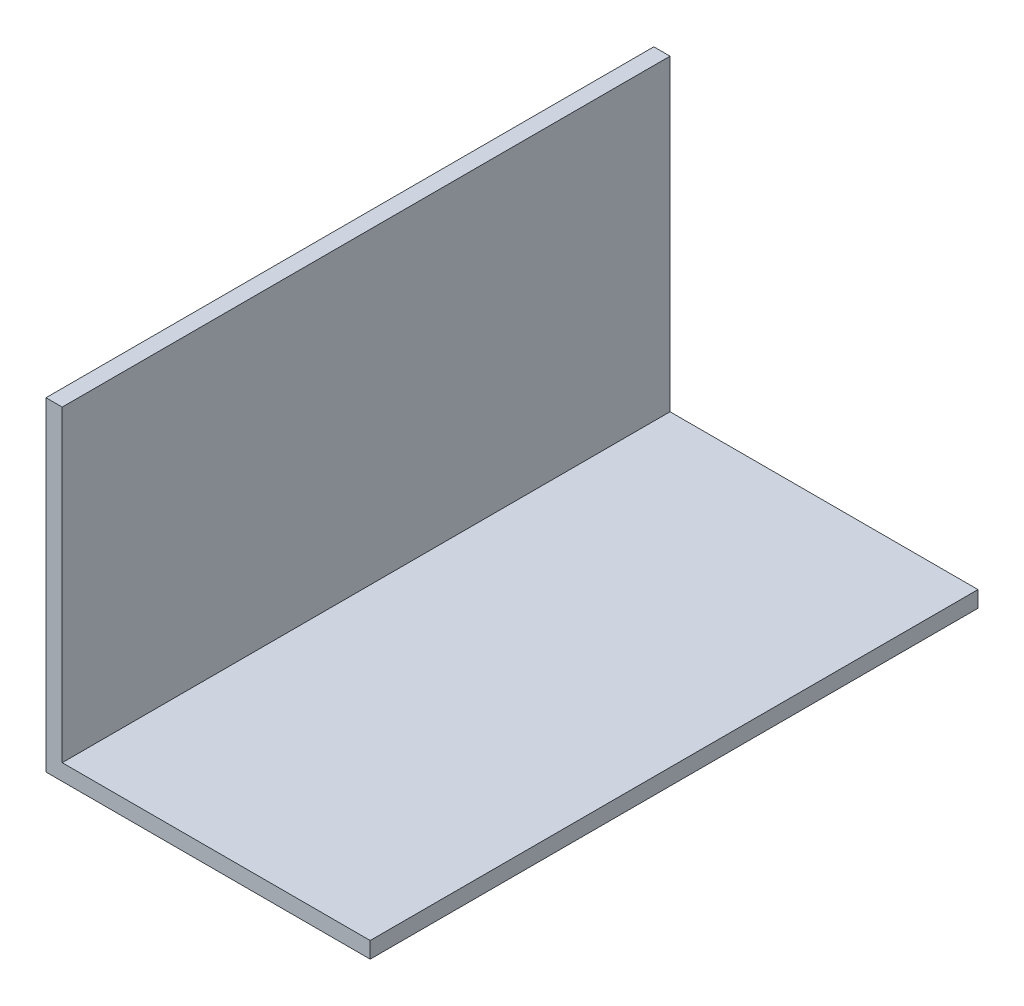
ISO-10303-21;
HEADER;
FILE_DESCRIPTION(('STEP AP214'),'2;1');
FILE_NAME('part.step','',(''),(''),'','','');
FILE_SCHEMA(('AUTOMOTIVE_DESIGN { 1 0 10303 214 1 1 1 1 }'));
ENDSEC;
DATA;
#1=APPLICATION_CONTEXT('core data for automotive mechanical design processes');
#2=APPLICATION_PROTOCOL_DEFINITION('international standard','automotive_design',2000,#1);
#3=PRODUCT_CONTEXT('',#1,'mechanical');
#4=PRODUCT('Part','Part','',(#3));
#5=PRODUCT_RELATED_PRODUCT_CATEGORY('part','',(#4));
#6=PRODUCT_DEFINITION_FORMATION('','',#4);
#7=PRODUCT_DEFINITION_CONTEXT('part definition',#1,'design');
#8=PRODUCT_DEFINITION('design','',#6,#7);
#9=PRODUCT_DEFINITION_SHAPE('','',#8);
#10=(LENGTH_UNIT() NAMED_UNIT(*) SI_UNIT(.MILLI.,.METRE.));
#11=(NAMED_UNIT(*) PLANE_ANGLE_UNIT() SI_UNIT($,.RADIAN.));
#12=(NAMED_UNIT(*) SI_UNIT($,.STERADIAN.) SOLID_ANGLE_UNIT());
#13=UNCERTAINTY_MEASURE_WITH_UNIT(LENGTH_MEASURE(1.E-05),#10,'distance_accuracy_value','');
#14=(GEOMETRIC_REPRESENTATION_CONTEXT(3) GLOBAL_UNCERTAINTY_ASSIGNED_CONTEXT((#13)) GLOBAL_UNIT_ASSIGNED_CONTEXT((#10,
#11,#12)) REPRESENTATION_CONTEXT('',''));
#15=CARTESIAN_POINT('',(0.,0.,0.));
#16=DIRECTION('',(0.,0.,1.));
#17=DIRECTION('',(1.,0.,0.));
#18=AXIS2_PLACEMENT_3D('',#15,#16,#17);
#19=CARTESIAN_POINT('',(-2.,0.,150.));
#20=DIRECTION('',(1.,0.,0.));
#21=DIRECTION('',(0.,1.,0.));
#22=AXIS2_PLACEMENT_3D('',#19,#20,#21);
#23=PLANE('',#22);
#24=DIRECTION('',(0.,-1.,0.));
#25=VECTOR('',#24,1.);
#26=CARTESIAN_POINT('',(-2.,0.,0.));
#27=LINE('',#26,#25);
#28=CARTESIAN_POINT('',(-2.,40.,0.));
#29=VERTEX_POINT('',#28);
#30=CARTESIAN_POINT('',(-2.,-40.,0.));
#31=VERTEX_POINT('',#30);
#32=EDGE_CURVE('E136',#29,#31,#27,.T.);
#33=ORIENTED_EDGE('',*,*,#32,.T.);
#34=DIRECTION('',(0.,0.,-1.));
#35=VECTOR('',#34,1.);
#36=CARTESIAN_POINT('',(-2.,-40.,150.));
#37=LINE('',#36,#35);
#38=CARTESIAN_POINT('',(-2.,-40.,150.));
#39=VERTEX_POINT('',#38);
#40=EDGE_CURVE('E11',#39,#31,#37,.T.);
#41=ORIENTED_EDGE('',*,*,#40,.F.);
#42=DIRECTION('',(0.,-1.,0.));
#43=VECTOR('',#42,1.);
#44=CARTESIAN_POINT('',(-2.,0.,150.));
#45=LINE('',#44,#43);
#46=CARTESIAN_POINT('',(-2.,40.,150.));
#47=VERTEX_POINT('',#46);
#48=EDGE_CURVE('E155',#47,#39,#45,.T.);
#49=ORIENTED_EDGE('',*,*,#48,.F.);
#50=DIRECTION('',(0.,0.,-1.));
#51=VECTOR('',#50,1.);
#52=CARTESIAN_POINT('',(-2.,40.,150.));
#53=LINE('',#52,#51);
#54=EDGE_CURVE('E64',#47,#29,#53,.T.);
#55=ORIENTED_EDGE('',*,*,#54,.T.);
#56=EDGE_LOOP('',(#33,#41,#49,#55));
#57=FACE_BOUND('',#56,.T.);
#58=ADVANCED_FACE('F47',(#57),#23,.F.);
#59=CARTESIAN_POINT('',(0.,-40.,150.));
#60=DIRECTION('',(0.,1.,0.));
#61=DIRECTION('',(0.,0.,1.));
#62=AXIS2_PLACEMENT_3D('',#59,#60,#61);
#63=PLANE('',#62);
#64=DIRECTION('',(1.,0.,0.));
#65=VECTOR('',#64,1.);
#66=CARTESIAN_POINT('',(0.,-40.,0.));
#67=LINE('',#66,#65);
#68=CARTESIAN_POINT('',(78.,-40.0000000000001,0.));
#69=VERTEX_POINT('',#68);
#70=EDGE_CURVE('E139',#31,#69,#67,.T.);
#71=ORIENTED_EDGE('',*,*,#70,.T.);
#72=DIRECTION('',(0.,0.,-1.));
#73=VECTOR('',#72,1.);
#74=CARTESIAN_POINT('',(78.,-40.0000000000001,150.));
#75=LINE('',#74,#73);
#76=CARTESIAN_POINT('',(78.,-40.0000000000001,150.));
#77=VERTEX_POINT('',#76);
#78=EDGE_CURVE('E56',#77,#69,#75,.T.);
#79=ORIENTED_EDGE('',*,*,#78,.F.);
#80=DIRECTION('',(1.,0.,0.));
#81=VECTOR('',#80,1.);
#82=CARTESIAN_POINT('',(0.,-40.,150.));
#83=LINE('',#82,#81);
#84=EDGE_CURVE('E96',#39,#77,#83,.T.);
#85=ORIENTED_EDGE('',*,*,#84,.F.);
#86=ORIENTED_EDGE('',*,*,#40,.T.);
#87=EDGE_LOOP('',(#71,#79,#85,#86));
#88=FACE_BOUND('',#87,.T.);
#89=ADVANCED_FACE('F179',(#88),#63,.F.);
#90=CARTESIAN_POINT('',(78.,0.,150.));
#91=DIRECTION('',(-1.,0.,0.));
#92=DIRECTION('',(0.,0.,1.));
#93=AXIS2_PLACEMENT_3D('',#90,#91,#92);
#94=PLANE('',#93);
#95=DIRECTION('',(0.,1.,0.));
#96=VECTOR('',#95,1.);
#97=CARTESIAN_POINT('',(78.,0.,0.));
#98=LINE('',#97,#96);
#99=CARTESIAN_POINT('',(78.,-36.0000000000001,0.));
#100=VERTEX_POINT('',#99);
#101=EDGE_CURVE('E142',#69,#100,#98,.T.);
#102=ORIENTED_EDGE('',*,*,#101,.T.);
#103=DIRECTION('',(0.,0.,-1.));
#104=VECTOR('',#103,1.);
#105=CARTESIAN_POINT('',(78.,-36.0000000000001,150.));
#106=LINE('',#105,#104);
#107=CARTESIAN_POINT('',(78.,-36.0000000000001,150.));
#108=VERTEX_POINT('',#107);
#109=EDGE_CURVE('E116',#108,#100,#106,.T.);
#110=ORIENTED_EDGE('',*,*,#109,.F.);
#111=DIRECTION('',(0.,1.,0.));
#112=VECTOR('',#111,1.);
#113=CARTESIAN_POINT('',(78.,0.,150.));
#114=LINE('',#113,#112);
#115=EDGE_CURVE('E124',#77,#108,#114,.T.);
#116=ORIENTED_EDGE('',*,*,#115,.F.);
#117=ORIENTED_EDGE('',*,*,#78,.T.);
#118=EDGE_LOOP('',(#102,#110,#116,#117));
#119=FACE_BOUND('',#118,.T.);
#120=ADVANCED_FACE('F165',(#119),#94,.F.);
#121=CARTESIAN_POINT('',(0.,-36.,150.));
#122=DIRECTION('',(0.,1.,0.));
#123=DIRECTION('',(-1.,0.,0.));
#124=AXIS2_PLACEMENT_3D('',#121,#122,#123);
#125=PLANE('',#124);
#126=DIRECTION('',(1.,0.,0.));
#127=VECTOR('',#126,1.);
#128=CARTESIAN_POINT('',(0.,-36.,0.));
#129=LINE('',#128,#127);
#130=CARTESIAN_POINT('',(2.,-36.,0.));
#131=VERTEX_POINT('',#130);
#132=EDGE_CURVE('E111',#131,#100,#129,.T.);
#133=ORIENTED_EDGE('',*,*,#132,.F.);
#134=DIRECTION('',(0.,0.,-1.));
#135=VECTOR('',#134,1.);
#136=CARTESIAN_POINT('',(2.,-36.,150.));
#137=LINE('',#136,#135);
#138=CARTESIAN_POINT('',(2.,-36.,150.));
#139=VERTEX_POINT('',#138);
#140=EDGE_CURVE('E106',#139,#131,#137,.T.);
#141=ORIENTED_EDGE('',*,*,#140,.F.);
#142=DIRECTION('',(1.,0.,0.));
#143=VECTOR('',#142,1.);
#144=CARTESIAN_POINT('',(0.,-36.,150.));
#145=LINE('',#144,#143);
#146=EDGE_CURVE('E109',#139,#108,#145,.T.);
#147=ORIENTED_EDGE('',*,*,#146,.T.);
#148=ORIENTED_EDGE('',*,*,#109,.T.);
#149=EDGE_LOOP('',(#133,#141,#147,#148));
#150=FACE_BOUND('',#149,.T.);
#151=ADVANCED_FACE('F108',(#150),#125,.T.);
#152=CARTESIAN_POINT('',(2.,0.,150.));
#153=DIRECTION('',(1.,0.,0.));
#154=DIRECTION('',(0.,1.,0.));
#155=AXIS2_PLACEMENT_3D('',#152,#153,#154);
#156=PLANE('',#155);
#157=DIRECTION('',(0.,-1.,0.));
#158=VECTOR('',#157,1.);
#159=CARTESIAN_POINT('',(2.,0.,0.));
#160=LINE('',#159,#158);
#161=CARTESIAN_POINT('',(1.99999999999999,40.,0.));
#162=VERTEX_POINT('',#161);
#163=EDGE_CURVE('E148',#162,#131,#160,.T.);
#164=ORIENTED_EDGE('',*,*,#163,.F.);
#165=DIRECTION('',(0.,0.,-1.));
#166=VECTOR('',#165,1.);
#167=CARTESIAN_POINT('',(1.99999999999999,40.,150.));
#168=LINE('',#167,#166);
#169=CARTESIAN_POINT('',(1.99999999999999,40.,150.));
#170=VERTEX_POINT('',#169);
#171=EDGE_CURVE('E84',#170,#162,#168,.T.);
#172=ORIENTED_EDGE('',*,*,#171,.F.);
#173=DIRECTION('',(0.,-1.,0.));
#174=VECTOR('',#173,1.);
#175=CARTESIAN_POINT('',(2.,0.,150.));
#176=LINE('',#175,#174);
#177=EDGE_CURVE('E122',#170,#139,#176,.T.);
#178=ORIENTED_EDGE('',*,*,#177,.T.);
#179=ORIENTED_EDGE('',*,*,#140,.T.);
#180=EDGE_LOOP('',(#164,#172,#178,#179));
#181=FACE_BOUND('',#180,.T.);
#182=ADVANCED_FACE('F128',(#181),#156,.T.);
#183=CARTESIAN_POINT('',(0.,40.,150.));
#184=DIRECTION('',(0.,1.,0.));
#185=DIRECTION('',(0.,0.,1.));
#186=AXIS2_PLACEMENT_3D('',#183,#184,#185);
#187=PLANE('',#186);
#188=DIRECTION('',(1.,0.,0.));
#189=VECTOR('',#188,1.);
#190=CARTESIAN_POINT('',(0.,40.,0.));
#191=LINE('',#190,#189);
#192=EDGE_CURVE('E151',#29,#162,#191,.T.);
#193=ORIENTED_EDGE('',*,*,#192,.F.);
#194=ORIENTED_EDGE('',*,*,#54,.F.);
#195=DIRECTION('',(1.,0.,0.));
#196=VECTOR('',#195,1.);
#197=CARTESIAN_POINT('',(0.,40.,150.));
#198=LINE('',#197,#196);
#199=EDGE_CURVE('E130',#47,#170,#198,.T.);
#200=ORIENTED_EDGE('',*,*,#199,.T.);
#201=ORIENTED_EDGE('',*,*,#171,.T.);
#202=EDGE_LOOP('',(#193,#194,#200,#201));
#203=FACE_BOUND('',#202,.T.);
#204=ADVANCED_FACE('F168',(#203),#187,.T.);
#205=CARTESIAN_POINT('',(0.,0.,150.));
#206=DIRECTION('',(0.,0.,1.));
#207=DIRECTION('',(1.,0.,0.));
#208=AXIS2_PLACEMENT_3D('',#205,#206,#207);
#209=PLANE('',#208);
#210=ORIENTED_EDGE('',*,*,#48,.T.);
#211=ORIENTED_EDGE('',*,*,#84,.T.);
#212=ORIENTED_EDGE('',*,*,#115,.T.);
#213=ORIENTED_EDGE('',*,*,#146,.F.);
#214=ORIENTED_EDGE('',*,*,#177,.F.);
#215=ORIENTED_EDGE('',*,*,#199,.F.);
#216=EDGE_LOOP('',(#210,#211,#212,#213,#214,#215));
#217=FACE_BOUND('',#216,.T.);
#218=ADVANCED_FACE('F120',(#217),#209,.T.);
#219=CARTESIAN_POINT('',(0.,0.,0.));
#220=DIRECTION('',(0.,0.,1.));
#221=DIRECTION('',(1.,0.,0.));
#222=AXIS2_PLACEMENT_3D('',#219,#220,#221);
#223=PLANE('',#222);
#224=ORIENTED_EDGE('',*,*,#32,.F.);
#225=ORIENTED_EDGE('',*,*,#192,.T.);
#226=ORIENTED_EDGE('',*,*,#163,.T.);
#227=ORIENTED_EDGE('',*,*,#132,.T.);
#228=ORIENTED_EDGE('',*,*,#101,.F.);
#229=ORIENTED_EDGE('',*,*,#70,.F.);
#230=EDGE_LOOP('',(#224,#225,#226,#227,#228,#229));
#231=FACE_BOUND('',#230,.T.);
#232=ADVANCED_FACE('F167',(#231),#223,.F.);
#233=CLOSED_SHELL('',(#58,#89,#120,#151,#182,#204,#218,#232));
#234=MANIFOLD_SOLID_BREP('B2',#233);
#235=ADVANCED_BREP_SHAPE_REPRESENTATION('',(#18,#234),#14);
#236=SHAPE_DEFINITION_REPRESENTATION(#9,#235);
ENDSEC;
END-ISO-10303-21;
